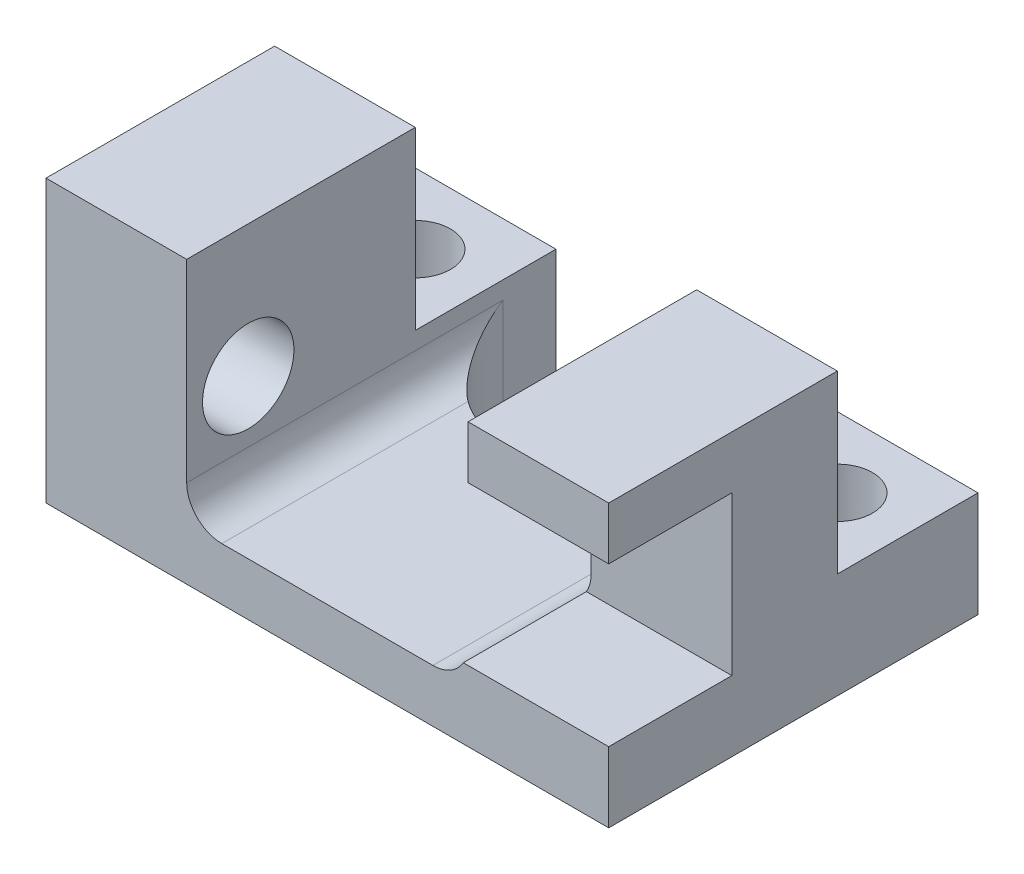
ISO-10303-21;
HEADER;
FILE_DESCRIPTION(('STEP AP214'),'2;1');
FILE_NAME('part.step','',(''),(''),'','','');
FILE_SCHEMA(('AUTOMOTIVE_DESIGN { 1 0 10303 214 1 1 1 1 }'));
ENDSEC;
DATA;
#1=APPLICATION_CONTEXT('core data for automotive mechanical design processes');
#2=APPLICATION_PROTOCOL_DEFINITION('international standard','automotive_design',2000,#1);
#3=PRODUCT_CONTEXT('',#1,'mechanical');
#4=PRODUCT('Part','Part','',(#3));
#5=PRODUCT_RELATED_PRODUCT_CATEGORY('part','',(#4));
#6=PRODUCT_DEFINITION_FORMATION('','',#4);
#7=PRODUCT_DEFINITION_CONTEXT('part definition',#1,'design');
#8=PRODUCT_DEFINITION('design','',#6,#7);
#9=PRODUCT_DEFINITION_SHAPE('','',#8);
#10=(LENGTH_UNIT() NAMED_UNIT(*) SI_UNIT(.MILLI.,.METRE.));
#11=(NAMED_UNIT(*) PLANE_ANGLE_UNIT() SI_UNIT($,.RADIAN.));
#12=(NAMED_UNIT(*) SI_UNIT($,.STERADIAN.) SOLID_ANGLE_UNIT());
#13=UNCERTAINTY_MEASURE_WITH_UNIT(LENGTH_MEASURE(1.E-05),#10,'distance_accuracy_value','');
#14=(GEOMETRIC_REPRESENTATION_CONTEXT(3) GLOBAL_UNCERTAINTY_ASSIGNED_CONTEXT((#13)) GLOBAL_UNIT_ASSIGNED_CONTEXT((#10,
#11,#12)) REPRESENTATION_CONTEXT('',''));
#15=CARTESIAN_POINT('',(0.,0.,0.));
#16=DIRECTION('',(0.,0.,1.));
#17=DIRECTION('',(1.,0.,0.));
#18=AXIS2_PLACEMENT_3D('',#15,#16,#17);
#19=CARTESIAN_POINT('',(-8.,4.,3.25));
#20=DIRECTION('',(0.,0.,-1.));
#21=DIRECTION('',(-1.,0.,0.));
#22=AXIS2_PLACEMENT_3D('',#19,#20,#21);
#23=PLANE('',#22);
#24=DIRECTION('',(0.,-1.,0.));
#25=VECTOR('',#24,1.);
#26=CARTESIAN_POINT('',(8.,4.,3.25));
#27=LINE('',#26,#25);
#28=CARTESIAN_POINT('',(8.,-2.,3.25));
#29=VERTEX_POINT('',#28);
#30=CARTESIAN_POINT('',(8.,-4.,3.25));
#31=VERTEX_POINT('',#30);
#32=EDGE_CURVE('E304',#29,#31,#27,.T.);
#33=ORIENTED_EDGE('',*,*,#32,.F.);
#34=DIRECTION('',(1.,0.,0.));
#35=VECTOR('',#34,1.);
#36=CARTESIAN_POINT('',(3.,-2.,3.25));
#37=LINE('',#36,#35);
#38=CARTESIAN_POINT('',(3.86602540378444,-2.,3.25));
#39=VERTEX_POINT('',#38);
#40=EDGE_CURVE('E211',#39,#29,#37,.T.);
#41=ORIENTED_EDGE('',*,*,#40,.F.);
#42=CARTESIAN_POINT('',(3.,-1.5,3.25));
#43=DIRECTION('',(0.,0.,-1.));
#44=DIRECTION('',(-1.,0.,0.));
#45=AXIS2_PLACEMENT_3D('',#42,#43,#44);
#46=CIRCLE('',#45,1.);
#47=CARTESIAN_POINT('',(3.,-2.5,3.25));
#48=VERTEX_POINT('',#47);
#49=EDGE_CURVE('E337',#39,#48,#46,.T.);
#50=ORIENTED_EDGE('',*,*,#49,.T.);
#51=DIRECTION('',(-1.,0.,0.));
#52=VECTOR('',#51,1.);
#53=CARTESIAN_POINT('',(-4.,-2.5,3.25));
#54=LINE('',#53,#52);
#55=CARTESIAN_POINT('',(-3.,-2.5,3.25));
#56=VERTEX_POINT('',#55);
#57=EDGE_CURVE('E270',#48,#56,#54,.T.);
#58=ORIENTED_EDGE('',*,*,#57,.T.);
#59=CARTESIAN_POINT('',(-3.,-1.5,3.25));
#60=DIRECTION('',(0.,0.,-1.));
#61=DIRECTION('',(-1.,0.,0.));
#62=AXIS2_PLACEMENT_3D('',#59,#60,#61);
#63=CIRCLE('',#62,1.);
#64=CARTESIAN_POINT('',(-4.,-1.5,3.25));
#65=VERTEX_POINT('',#64);
#66=EDGE_CURVE('E335',#56,#65,#63,.T.);
#67=ORIENTED_EDGE('',*,*,#66,.T.);
#68=DIRECTION('',(0.,1.,0.));
#69=VECTOR('',#68,1.);
#70=CARTESIAN_POINT('',(-4.,-2.5,3.25));
#71=LINE('',#70,#69);
#72=CARTESIAN_POINT('',(-4.,4.,3.25));
#73=VERTEX_POINT('',#72);
#74=EDGE_CURVE('E285',#65,#73,#71,.T.);
#75=ORIENTED_EDGE('',*,*,#74,.T.);
#76=DIRECTION('',(1.,0.,0.));
#77=VECTOR('',#76,1.);
#78=CARTESIAN_POINT('',(-8.,4.,3.25));
#79=LINE('',#78,#77);
#80=CARTESIAN_POINT('',(-8.,4.,3.25));
#81=VERTEX_POINT('',#80);
#82=EDGE_CURVE('E301',#81,#73,#79,.T.);
#83=ORIENTED_EDGE('',*,*,#82,.F.);
#84=DIRECTION('',(0.,-1.,0.));
#85=VECTOR('',#84,1.);
#86=CARTESIAN_POINT('',(-8.,4.,3.25));
#87=LINE('',#86,#85);
#88=CARTESIAN_POINT('',(-8.,-4.,3.25));
#89=VERTEX_POINT('',#88);
#90=EDGE_CURVE('E314',#81,#89,#87,.T.);
#91=ORIENTED_EDGE('',*,*,#90,.T.);
#92=DIRECTION('',(1.,0.,0.));
#93=VECTOR('',#92,1.);
#94=CARTESIAN_POINT('',(-8.,-4.,3.25));
#95=LINE('',#94,#93);
#96=EDGE_CURVE('E294',#89,#31,#95,.T.);
#97=ORIENTED_EDGE('',*,*,#96,.T.);
#98=EDGE_LOOP('',(#33,#41,#50,#58,#67,#75,#83,#91,#97));
#99=FACE_BOUND('',#98,.T.);
#100=ADVANCED_FACE('F32',(#99),#23,.F.);
#101=CARTESIAN_POINT('',(-8.,4.,-3.25));
#102=DIRECTION('',(0.,0.,1.));
#103=DIRECTION('',(1.,0.,0.));
#104=AXIS2_PLACEMENT_3D('',#101,#102,#103);
#105=PLANE('',#104);
#106=DIRECTION('',(-1.,0.,0.));
#107=VECTOR('',#106,1.);
#108=CARTESIAN_POINT('',(-8.,-1.,-3.25));
#109=LINE('',#108,#107);
#110=CARTESIAN_POINT('',(-4.,-1.,-3.25));
#111=VERTEX_POINT('',#110);
#112=CARTESIAN_POINT('',(-8.,-1.,-3.25));
#113=VERTEX_POINT('',#112);
#114=EDGE_CURVE('E233',#111,#113,#109,.T.);
#115=ORIENTED_EDGE('',*,*,#114,.T.);
#116=DIRECTION('',(0.,-1.,0.));
#117=VECTOR('',#116,1.);
#118=CARTESIAN_POINT('',(-8.,4.,-3.25));
#119=LINE('',#118,#117);
#120=CARTESIAN_POINT('',(-8.,4.,-3.25));
#121=VERTEX_POINT('',#120);
#122=EDGE_CURVE('E317',#121,#113,#119,.T.);
#123=ORIENTED_EDGE('',*,*,#122,.F.);
#124=DIRECTION('',(-1.,0.,0.));
#125=VECTOR('',#124,1.);
#126=CARTESIAN_POINT('',(-8.,4.,-3.25));
#127=LINE('',#126,#125);
#128=CARTESIAN_POINT('',(-4.,4.,-3.25));
#129=VERTEX_POINT('',#128);
#130=EDGE_CURVE('E293',#129,#121,#127,.T.);
#131=ORIENTED_EDGE('',*,*,#130,.F.);
#132=DIRECTION('',(0.,1.,0.));
#133=VECTOR('',#132,1.);
#134=CARTESIAN_POINT('',(-4.,-2.5,-3.25));
#135=LINE('',#134,#133);
#136=EDGE_CURVE('E283',#111,#129,#135,.T.);
#137=ORIENTED_EDGE('',*,*,#136,.F.);
#138=EDGE_LOOP('',(#115,#123,#131,#137));
#139=FACE_BOUND('',#138,.T.);
#140=ADVANCED_FACE('F452',(#139),#105,.F.);
#141=DIRECTION('',(0.,-1.,0.));
#142=VECTOR('',#141,1.);
#143=CARTESIAN_POINT('',(8.,4.,-3.25));
#144=LINE('',#143,#142);
#145=CARTESIAN_POINT('',(8.,4.,-3.25));
#146=VERTEX_POINT('',#145);
#147=CARTESIAN_POINT('',(8.,-1.,-3.25));
#148=VERTEX_POINT('',#147);
#149=EDGE_CURVE('E320',#146,#148,#144,.T.);
#150=ORIENTED_EDGE('',*,*,#149,.T.);
#151=DIRECTION('',(-1.,0.,0.));
#152=VECTOR('',#151,1.);
#153=CARTESIAN_POINT('',(8.,-1.,-3.25));
#154=LINE('',#153,#152);
#155=CARTESIAN_POINT('',(4.,-1.,-3.25));
#156=VERTEX_POINT('',#155);
#157=EDGE_CURVE('E250',#148,#156,#154,.T.);
#158=ORIENTED_EDGE('',*,*,#157,.T.);
#159=DIRECTION('',(0.,1.,0.));
#160=VECTOR('',#159,1.);
#161=CARTESIAN_POINT('',(4.,-2.5,-3.25));
#162=LINE('',#161,#160);
#163=CARTESIAN_POINT('',(4.,4.,-3.25));
#164=VERTEX_POINT('',#163);
#165=EDGE_CURVE('E277',#156,#164,#162,.T.);
#166=ORIENTED_EDGE('',*,*,#165,.T.);
#167=EDGE_CURVE('E295',#146,#164,#127,.T.);
#168=ORIENTED_EDGE('',*,*,#167,.F.);
#169=EDGE_LOOP('',(#150,#158,#166,#168));
#170=FACE_BOUND('',#169,.T.);
#171=ADVANCED_FACE('F433',(#170),#105,.F.);
#172=DIRECTION('',(-1.,0.,0.));
#173=VECTOR('',#172,1.);
#174=CARTESIAN_POINT('',(-8.,-4.,-3.25));
#175=LINE('',#174,#173);
#176=CARTESIAN_POINT('',(1.5,-4.,-3.25));
#177=VERTEX_POINT('',#176);
#178=CARTESIAN_POINT('',(-1.5,-4.,-3.25));
#179=VERTEX_POINT('',#178);
#180=EDGE_CURVE('E306',#177,#179,#175,.T.);
#181=ORIENTED_EDGE('',*,*,#180,.T.);
#182=DIRECTION('',(0.,-1.,0.));
#183=VECTOR('',#182,1.);
#184=CARTESIAN_POINT('',(-1.5,4.,-3.25));
#185=LINE('',#184,#183);
#186=CARTESIAN_POINT('',(-1.5,-2.5,-3.25));
#187=VERTEX_POINT('',#186);
#188=EDGE_CURVE('E345',#179,#187,#185,.F.);
#189=ORIENTED_EDGE('',*,*,#188,.T.);
#190=DIRECTION('',(1.,0.,0.));
#191=VECTOR('',#190,1.);
#192=CARTESIAN_POINT('',(-4.,-2.5,-3.25));
#193=LINE('',#192,#191);
#194=CARTESIAN_POINT('',(1.5,-2.5,-3.25));
#195=VERTEX_POINT('',#194);
#196=EDGE_CURVE('E273',#187,#195,#193,.T.);
#197=ORIENTED_EDGE('',*,*,#196,.T.);
#198=DIRECTION('',(0.,-1.,0.));
#199=VECTOR('',#198,1.);
#200=CARTESIAN_POINT('',(1.5,4.,-3.25));
#201=LINE('',#200,#199);
#202=EDGE_CURVE('E342',#195,#177,#201,.T.);
#203=ORIENTED_EDGE('',*,*,#202,.T.);
#204=EDGE_LOOP('',(#181,#189,#197,#203));
#205=FACE_BOUND('',#204,.T.);
#206=ADVANCED_FACE('F443',(#205),#105,.F.);
#207=DIRECTION('',(0.,1.,0.));
#208=VECTOR('',#207,1.);
#209=CARTESIAN_POINT('',(4.,-2.5,3.25));
#210=LINE('',#209,#208);
#211=CARTESIAN_POINT('',(4.,2.5,3.25));
#212=VERTEX_POINT('',#211);
#213=CARTESIAN_POINT('',(4.,4.,3.25));
#214=VERTEX_POINT('',#213);
#215=EDGE_CURVE('E287',#212,#214,#210,.T.);
#216=ORIENTED_EDGE('',*,*,#215,.F.);
#217=DIRECTION('',(1.,0.,0.));
#218=VECTOR('',#217,1.);
#219=CARTESIAN_POINT('',(3.,2.5,3.25));
#220=LINE('',#219,#218);
#221=CARTESIAN_POINT('',(8.,2.5,3.25));
#222=VERTEX_POINT('',#221);
#223=EDGE_CURVE('E190',#212,#222,#220,.T.);
#224=ORIENTED_EDGE('',*,*,#223,.T.);
#225=CARTESIAN_POINT('',(8.,4.,3.25));
#226=VERTEX_POINT('',#225);
#227=EDGE_CURVE('E204',#226,#222,#27,.T.);
#228=ORIENTED_EDGE('',*,*,#227,.F.);
#229=EDGE_CURVE('E300',#214,#226,#79,.T.);
#230=ORIENTED_EDGE('',*,*,#229,.F.);
#231=EDGE_LOOP('',(#216,#224,#228,#230));
#232=FACE_BOUND('',#231,.T.);
#233=ADVANCED_FACE('F441',(#232),#23,.F.);
#234=CARTESIAN_POINT('',(0.,4.,0.));
#235=DIRECTION('',(0.,-1.,0.));
#236=DIRECTION('',(0.,0.,-1.));
#237=AXIS2_PLACEMENT_3D('',#234,#235,#236);
#238=PLANE('',#237);
#239=DIRECTION('',(0.,0.,1.));
#240=VECTOR('',#239,1.);
#241=CARTESIAN_POINT('',(4.,4.,3.25));
#242=LINE('',#241,#240);
#243=EDGE_CURVE('E267',#164,#214,#242,.T.);
#244=ORIENTED_EDGE('',*,*,#243,.T.);
#245=ORIENTED_EDGE('',*,*,#229,.T.);
#246=DIRECTION('',(0.,0.,-1.));
#247=VECTOR('',#246,1.);
#248=CARTESIAN_POINT('',(8.,4.,3.25));
#249=LINE('',#248,#247);
#250=EDGE_CURVE('E290',#226,#146,#249,.T.);
#251=ORIENTED_EDGE('',*,*,#250,.T.);
#252=ORIENTED_EDGE('',*,*,#167,.T.);
#253=EDGE_LOOP('',(#244,#245,#251,#252));
#254=FACE_BOUND('',#253,.T.);
#255=ADVANCED_FACE('F437',(#254),#238,.F.);
#256=DIRECTION('',(0.,0.,-1.));
#257=VECTOR('',#256,1.);
#258=CARTESIAN_POINT('',(-4.,4.,3.25));
#259=LINE('',#258,#257);
#260=EDGE_CURVE('E274',#73,#129,#259,.T.);
#261=ORIENTED_EDGE('',*,*,#260,.T.);
#262=ORIENTED_EDGE('',*,*,#130,.T.);
#263=DIRECTION('',(0.,0.,1.));
#264=VECTOR('',#263,1.);
#265=CARTESIAN_POINT('',(-8.,4.,3.25));
#266=LINE('',#265,#264);
#267=EDGE_CURVE('E298',#121,#81,#266,.T.);
#268=ORIENTED_EDGE('',*,*,#267,.T.);
#269=ORIENTED_EDGE('',*,*,#82,.T.);
#270=EDGE_LOOP('',(#261,#262,#268,#269));
#271=FACE_BOUND('',#270,.T.);
#272=ADVANCED_FACE('F416',(#271),#238,.F.);
#273=CARTESIAN_POINT('',(8.,4.,3.25));
#274=DIRECTION('',(-1.,0.,0.));
#275=DIRECTION('',(0.,0.,1.));
#276=AXIS2_PLACEMENT_3D('',#273,#274,#275);
#277=PLANE('',#276);
#278=DIRECTION('',(0.,1.,0.));
#279=VECTOR('',#278,1.);
#280=CARTESIAN_POINT('',(8.,2.5,-0.25));
#281=LINE('',#280,#279);
#282=CARTESIAN_POINT('',(8.,-2.,-0.25));
#283=VERTEX_POINT('',#282);
#284=CARTESIAN_POINT('',(8.,2.5,-0.25));
#285=VERTEX_POINT('',#284);
#286=EDGE_CURVE('E194',#283,#285,#281,.T.);
#287=ORIENTED_EDGE('',*,*,#286,.F.);
#288=DIRECTION('',(0.,0.,-1.));
#289=VECTOR('',#288,1.);
#290=CARTESIAN_POINT('',(8.,-2.,-0.25));
#291=LINE('',#290,#289);
#292=EDGE_CURVE('E191',#29,#283,#291,.T.);
#293=ORIENTED_EDGE('',*,*,#292,.F.);
#294=ORIENTED_EDGE('',*,*,#32,.T.);
#295=DIRECTION('',(0.,0.,-1.));
#296=VECTOR('',#295,1.);
#297=CARTESIAN_POINT('',(8.,-4.,3.25));
#298=LINE('',#297,#296);
#299=CARTESIAN_POINT('',(8.,-4.,-7.25));
#300=VERTEX_POINT('',#299);
#301=EDGE_CURVE('E289',#31,#300,#298,.T.);
#302=ORIENTED_EDGE('',*,*,#301,.T.);
#303=DIRECTION('',(0.,-1.,0.));
#304=VECTOR('',#303,1.);
#305=CARTESIAN_POINT('',(8.,-1.,-7.25));
#306=LINE('',#305,#304);
#307=CARTESIAN_POINT('',(8.,-1.,-7.25));
#308=VERTEX_POINT('',#307);
#309=EDGE_CURVE('E264',#308,#300,#306,.T.);
#310=ORIENTED_EDGE('',*,*,#309,.F.);
#311=DIRECTION('',(0.,0.,1.));
#312=VECTOR('',#311,1.);
#313=CARTESIAN_POINT('',(8.,-1.,-3.25));
#314=LINE('',#313,#312);
#315=EDGE_CURVE('E247',#308,#148,#314,.T.);
#316=ORIENTED_EDGE('',*,*,#315,.T.);
#317=ORIENTED_EDGE('',*,*,#149,.F.);
#318=ORIENTED_EDGE('',*,*,#250,.F.);
#319=ORIENTED_EDGE('',*,*,#227,.T.);
#320=DIRECTION('',(0.,0.,1.));
#321=VECTOR('',#320,1.);
#322=CARTESIAN_POINT('',(8.,2.5,-0.25));
#323=LINE('',#322,#321);
#324=EDGE_CURVE('E185',#285,#222,#323,.T.);
#325=ORIENTED_EDGE('',*,*,#324,.F.);
#326=EDGE_LOOP('',(#287,#293,#294,#302,#310,#316,#317,#318,#319,#325));
#327=FACE_BOUND('',#326,.T.);
#328=ADVANCED_FACE('F201',(#327),#277,.F.);
#329=CARTESIAN_POINT('',(-8.,4.,3.25));
#330=DIRECTION('',(1.,0.,0.));
#331=DIRECTION('',(0.,0.,-1.));
#332=AXIS2_PLACEMENT_3D('',#329,#330,#331);
#333=PLANE('',#332);
#334=CARTESIAN_POINT('',(-8.,0.250000000000001,1.5));
#335=DIRECTION('',(-1.,0.,0.));
#336=DIRECTION('',(0.,0.,1.));
#337=AXIS2_PLACEMENT_3D('',#334,#335,#336);
#338=CIRCLE('',#337,1.3);
#339=CARTESIAN_POINT('',(-8.,0.250000000000001,2.8));
#340=VERTEX_POINT('',#339);
#341=EDGE_CURVE('E521',#340,#340,#338,.T.);
#342=ORIENTED_EDGE('',*,*,#341,.F.);
#343=EDGE_LOOP('',(#342));
#344=FACE_BOUND('',#343,.T.);
#345=DIRECTION('',(0.,0.,1.));
#346=VECTOR('',#345,1.);
#347=CARTESIAN_POINT('',(-8.,-4.,3.25));
#348=LINE('',#347,#346);
#349=CARTESIAN_POINT('',(-8.,-4.,-7.25));
#350=VERTEX_POINT('',#349);
#351=EDGE_CURVE('E309',#350,#89,#348,.T.);
#352=ORIENTED_EDGE('',*,*,#351,.T.);
#353=ORIENTED_EDGE('',*,*,#90,.F.);
#354=ORIENTED_EDGE('',*,*,#267,.F.);
#355=ORIENTED_EDGE('',*,*,#122,.T.);
#356=DIRECTION('',(0.,0.,-1.));
#357=VECTOR('',#356,1.);
#358=CARTESIAN_POINT('',(-8.,-1.,-3.25));
#359=LINE('',#358,#357);
#360=CARTESIAN_POINT('',(-8.,-1.,-7.25));
#361=VERTEX_POINT('',#360);
#362=EDGE_CURVE('E223',#113,#361,#359,.T.);
#363=ORIENTED_EDGE('',*,*,#362,.T.);
#364=DIRECTION('',(0.,-1.,0.));
#365=VECTOR('',#364,1.);
#366=CARTESIAN_POINT('',(-8.,-1.,-7.25));
#367=LINE('',#366,#365);
#368=EDGE_CURVE('E236',#361,#350,#367,.T.);
#369=ORIENTED_EDGE('',*,*,#368,.T.);
#370=EDGE_LOOP('',(#352,#353,#354,#355,#363,#369));
#371=FACE_BOUND('',#370,.T.);
#372=ADVANCED_FACE('F463',(#344,#371),#333,.F.);
#373=CARTESIAN_POINT('',(0.,-4.,0.));
#374=DIRECTION('',(0.,-1.,0.));
#375=DIRECTION('',(0.,0.,-1.));
#376=AXIS2_PLACEMENT_3D('',#373,#374,#375);
#377=PLANE('',#376);
#378=CARTESIAN_POINT('',(6.,-4.,-5.25));
#379=DIRECTION('',(0.,-1.,0.));
#380=DIRECTION('',(0.,0.,-1.));
#381=AXIS2_PLACEMENT_3D('',#378,#379,#380);
#382=CIRCLE('',#381,0.999999999999999);
#383=CARTESIAN_POINT('',(6.,-4.,-6.25));
#384=VERTEX_POINT('',#383);
#385=EDGE_CURVE('E218',#384,#384,#382,.T.);
#386=ORIENTED_EDGE('',*,*,#385,.F.);
#387=EDGE_LOOP('',(#386));
#388=FACE_BOUND('',#387,.T.);
#389=CARTESIAN_POINT('',(-6.,-4.,-5.25));
#390=DIRECTION('',(0.,-1.,0.));
#391=DIRECTION('',(0.,0.,-1.));
#392=AXIS2_PLACEMENT_3D('',#389,#390,#391);
#393=CIRCLE('',#392,0.999999999999999);
#394=CARTESIAN_POINT('',(-6.,-4.,-6.25));
#395=VERTEX_POINT('',#394);
#396=EDGE_CURVE('E222',#395,#395,#393,.T.);
#397=ORIENTED_EDGE('',*,*,#396,.F.);
#398=EDGE_LOOP('',(#397));
#399=FACE_BOUND('',#398,.T.);
#400=ORIENTED_EDGE('',*,*,#301,.F.);
#401=ORIENTED_EDGE('',*,*,#96,.F.);
#402=ORIENTED_EDGE('',*,*,#351,.F.);
#403=DIRECTION('',(1.,0.,0.));
#404=VECTOR('',#403,1.);
#405=CARTESIAN_POINT('',(-8.,-4.,-7.25));
#406=LINE('',#405,#404);
#407=CARTESIAN_POINT('',(-4.,-4.,-7.25));
#408=VERTEX_POINT('',#407);
#409=EDGE_CURVE('E237',#350,#408,#406,.T.);
#410=ORIENTED_EDGE('',*,*,#409,.T.);
#411=DIRECTION('',(0.,0.,1.));
#412=VECTOR('',#411,1.);
#413=CARTESIAN_POINT('',(-4.,-4.,-3.25));
#414=LINE('',#413,#412);
#415=CARTESIAN_POINT('',(-4.,-4.,-5.75));
#416=VERTEX_POINT('',#415);
#417=EDGE_CURVE('E227',#408,#416,#414,.T.);
#418=ORIENTED_EDGE('',*,*,#417,.T.);
#419=CARTESIAN_POINT('',(-1.5,-4.,-5.75));
#420=DIRECTION('',(0.,-1.,0.));
#421=DIRECTION('',(0.,0.,-1.));
#422=AXIS2_PLACEMENT_3D('',#419,#420,#421);
#423=CIRCLE('',#422,2.5);
#424=EDGE_CURVE('E350',#416,#179,#423,.F.);
#425=ORIENTED_EDGE('',*,*,#424,.T.);
#426=ORIENTED_EDGE('',*,*,#180,.F.);
#427=CARTESIAN_POINT('',(1.5,-4.,-5.75));
#428=DIRECTION('',(0.,-1.,0.));
#429=DIRECTION('',(0.,0.,-1.));
#430=AXIS2_PLACEMENT_3D('',#427,#428,#429);
#431=CIRCLE('',#430,2.5);
#432=CARTESIAN_POINT('',(4.,-4.,-5.75));
#433=VERTEX_POINT('',#432);
#434=EDGE_CURVE('E363',#177,#433,#431,.F.);
#435=ORIENTED_EDGE('',*,*,#434,.T.);
#436=DIRECTION('',(0.,0.,-1.));
#437=VECTOR('',#436,1.);
#438=CARTESIAN_POINT('',(4.,-4.,-3.25));
#439=LINE('',#438,#437);
#440=CARTESIAN_POINT('',(4.,-4.,-7.25));
#441=VERTEX_POINT('',#440);
#442=EDGE_CURVE('E244',#433,#441,#439,.T.);
#443=ORIENTED_EDGE('',*,*,#442,.T.);
#444=DIRECTION('',(1.,0.,0.));
#445=VECTOR('',#444,1.);
#446=CARTESIAN_POINT('',(8.,-4.,-7.25));
#447=LINE('',#446,#445);
#448=EDGE_CURVE('E251',#441,#300,#447,.T.);
#449=ORIENTED_EDGE('',*,*,#448,.T.);
#450=EDGE_LOOP('',(#400,#401,#402,#410,#418,#425,#426,#435,#443,#449));
#451=FACE_BOUND('',#450,.T.);
#452=ADVANCED_FACE('F423',(#388,#399,#451),#377,.T.);
#453=CARTESIAN_POINT('',(4.,-2.5,3.25));
#454=DIRECTION('',(-1.,0.,0.));
#455=DIRECTION('',(0.,0.,1.));
#456=AXIS2_PLACEMENT_3D('',#453,#454,#455);
#457=PLANE('',#456);
#458=DIRECTION('',(0.,-1.,0.));
#459=VECTOR('',#458,1.);
#460=CARTESIAN_POINT('',(4.,-2.5,-0.25));
#461=LINE('',#460,#459);
#462=CARTESIAN_POINT('',(4.,2.5,-0.25));
#463=VERTEX_POINT('',#462);
#464=CARTESIAN_POINT('',(4.,-1.5,-0.25));
#465=VERTEX_POINT('',#464);
#466=EDGE_CURVE('E210',#463,#465,#461,.T.);
#467=ORIENTED_EDGE('',*,*,#466,.F.);
#468=DIRECTION('',(0.,0.,-1.));
#469=VECTOR('',#468,1.);
#470=CARTESIAN_POINT('',(4.,2.5,3.25));
#471=LINE('',#470,#469);
#472=EDGE_CURVE('E11',#212,#463,#471,.T.);
#473=ORIENTED_EDGE('',*,*,#472,.F.);
#474=ORIENTED_EDGE('',*,*,#215,.T.);
#475=ORIENTED_EDGE('',*,*,#243,.F.);
#476=ORIENTED_EDGE('',*,*,#165,.F.);
#477=DIRECTION('',(0.,0.,-1.));
#478=VECTOR('',#477,1.);
#479=CARTESIAN_POINT('',(4.,-1.,-3.25));
#480=LINE('',#479,#478);
#481=CARTESIAN_POINT('',(4.,-1.,-7.25));
#482=VERTEX_POINT('',#481);
#483=EDGE_CURVE('E254',#156,#482,#480,.T.);
#484=ORIENTED_EDGE('',*,*,#483,.T.);
#485=DIRECTION('',(0.,-1.,0.));
#486=VECTOR('',#485,1.);
#487=CARTESIAN_POINT('',(4.,-1.,-7.25));
#488=LINE('',#487,#486);
#489=EDGE_CURVE('E260',#482,#441,#488,.T.);
#490=ORIENTED_EDGE('',*,*,#489,.T.);
#491=ORIENTED_EDGE('',*,*,#442,.F.);
#492=DIRECTION('',(0.,-1.,0.));
#493=VECTOR('',#492,1.);
#494=CARTESIAN_POINT('',(4.,-2.5,-5.75));
#495=LINE('',#494,#493);
#496=CARTESIAN_POINT('',(4.,-1.5,-5.75));
#497=VERTEX_POINT('',#496);
#498=EDGE_CURVE('E347',#433,#497,#495,.F.);
#499=ORIENTED_EDGE('',*,*,#498,.T.);
#500=DIRECTION('',(0.,0.,1.));
#501=VECTOR('',#500,1.);
#502=CARTESIAN_POINT('',(4.,-1.5,3.25));
#503=LINE('',#502,#501);
#504=EDGE_CURVE('E332',#497,#465,#503,.T.);
#505=ORIENTED_EDGE('',*,*,#504,.T.);
#506=EDGE_LOOP('',(#467,#473,#474,#475,#476,#484,#490,#491,#499,#505));
#507=FACE_BOUND('',#506,.T.);
#508=ADVANCED_FACE('F390',(#507),#457,.T.);
#509=CARTESIAN_POINT('',(-4.,-2.5,3.25));
#510=DIRECTION('',(1.,0.,0.));
#511=DIRECTION('',(0.,0.,-1.));
#512=AXIS2_PLACEMENT_3D('',#509,#510,#511);
#513=PLANE('',#512);
#514=CARTESIAN_POINT('',(-4.,0.250000000000001,1.5));
#515=DIRECTION('',(-1.,0.,0.));
#516=DIRECTION('',(0.,0.,1.));
#517=AXIS2_PLACEMENT_3D('',#514,#515,#516);
#518=CIRCLE('',#517,1.3);
#519=CARTESIAN_POINT('',(-4.,0.250000000000001,2.8));
#520=VERTEX_POINT('',#519);
#521=EDGE_CURVE('E198',#520,#520,#518,.T.);
#522=ORIENTED_EDGE('',*,*,#521,.T.);
#523=EDGE_LOOP('',(#522));
#524=FACE_BOUND('',#523,.T.);
#525=DIRECTION('',(0.,0.,-1.));
#526=VECTOR('',#525,1.);
#527=CARTESIAN_POINT('',(-4.,-1.5,3.25));
#528=LINE('',#527,#526);
#529=CARTESIAN_POINT('',(-4.,-1.5,-5.75));
#530=VERTEX_POINT('',#529);
#531=EDGE_CURVE('E323',#65,#530,#528,.T.);
#532=ORIENTED_EDGE('',*,*,#531,.T.);
#533=DIRECTION('',(0.,-1.,0.));
#534=VECTOR('',#533,1.);
#535=CARTESIAN_POINT('',(-4.,-2.5,-5.75));
#536=LINE('',#535,#534);
#537=EDGE_CURVE('E339',#530,#416,#536,.T.);
#538=ORIENTED_EDGE('',*,*,#537,.T.);
#539=ORIENTED_EDGE('',*,*,#417,.F.);
#540=DIRECTION('',(0.,-1.,0.));
#541=VECTOR('',#540,1.);
#542=CARTESIAN_POINT('',(-4.,-1.,-7.25));
#543=LINE('',#542,#541);
#544=CARTESIAN_POINT('',(-4.,-1.,-7.25));
#545=VERTEX_POINT('',#544);
#546=EDGE_CURVE('E242',#545,#408,#543,.T.);
#547=ORIENTED_EDGE('',*,*,#546,.F.);
#548=DIRECTION('',(0.,0.,1.));
#549=VECTOR('',#548,1.);
#550=CARTESIAN_POINT('',(-4.,-1.,-3.25));
#551=LINE('',#550,#549);
#552=EDGE_CURVE('E230',#545,#111,#551,.T.);
#553=ORIENTED_EDGE('',*,*,#552,.T.);
#554=ORIENTED_EDGE('',*,*,#136,.T.);
#555=ORIENTED_EDGE('',*,*,#260,.F.);
#556=ORIENTED_EDGE('',*,*,#74,.F.);
#557=EDGE_LOOP('',(#532,#538,#539,#547,#553,#554,#555,#556));
#558=FACE_BOUND('',#557,.T.);
#559=ADVANCED_FACE('F412',(#524,#558),#513,.T.);
#560=CARTESIAN_POINT('',(0.,-2.5,0.));
#561=DIRECTION('',(0.,-1.,0.));
#562=DIRECTION('',(0.,0.,-1.));
#563=AXIS2_PLACEMENT_3D('',#560,#561,#562);
#564=PLANE('',#563);
#565=ORIENTED_EDGE('',*,*,#196,.F.);
#566=CARTESIAN_POINT('',(-1.5,-2.5,-5.75));
#567=DIRECTION('',(0.,-1.,0.));
#568=DIRECTION('',(0.,0.,-1.));
#569=AXIS2_PLACEMENT_3D('',#566,#567,#568);
#570=CIRCLE('',#569,2.5);
#571=CARTESIAN_POINT('',(-3.,-2.5,-3.74999999999967));
#572=VERTEX_POINT('',#571);
#573=EDGE_CURVE('E352',#187,#572,#570,.T.);
#574=ORIENTED_EDGE('',*,*,#573,.T.);
#575=DIRECTION('',(0.,0.,-1.));
#576=VECTOR('',#575,1.);
#577=CARTESIAN_POINT('',(-3.,-2.5,0.));
#578=LINE('',#577,#576);
#579=EDGE_CURVE('E330',#572,#56,#578,.F.);
#580=ORIENTED_EDGE('',*,*,#579,.T.);
#581=ORIENTED_EDGE('',*,*,#57,.F.);
#582=DIRECTION('',(0.,0.,1.));
#583=VECTOR('',#582,1.);
#584=CARTESIAN_POINT('',(3.,-2.5,0.));
#585=LINE('',#584,#583);
#586=CARTESIAN_POINT('',(3.,-2.5,-3.74999999999967));
#587=VERTEX_POINT('',#586);
#588=EDGE_CURVE('E56',#48,#587,#585,.F.);
#589=ORIENTED_EDGE('',*,*,#588,.T.);
#590=CARTESIAN_POINT('',(1.5,-2.5,-5.75));
#591=DIRECTION('',(0.,-1.,0.));
#592=DIRECTION('',(0.,0.,-1.));
#593=AXIS2_PLACEMENT_3D('',#590,#591,#592);
#594=CIRCLE('',#593,2.5);
#595=EDGE_CURVE('E383',#587,#195,#594,.T.);
#596=ORIENTED_EDGE('',*,*,#595,.T.);
#597=EDGE_LOOP('',(#565,#574,#580,#581,#589,#596));
#598=FACE_BOUND('',#597,.T.);
#599=ADVANCED_FACE('F402',(#598),#564,.F.);
#600=CARTESIAN_POINT('',(8.,-1.,-7.25));
#601=DIRECTION('',(0.,0.,-1.));
#602=DIRECTION('',(-1.,0.,0.));
#603=AXIS2_PLACEMENT_3D('',#600,#601,#602);
#604=PLANE('',#603);
#605=ORIENTED_EDGE('',*,*,#448,.F.);
#606=ORIENTED_EDGE('',*,*,#489,.F.);
#607=DIRECTION('',(1.,0.,0.));
#608=VECTOR('',#607,1.);
#609=CARTESIAN_POINT('',(8.,-1.,-7.25));
#610=LINE('',#609,#608);
#611=EDGE_CURVE('E257',#482,#308,#610,.T.);
#612=ORIENTED_EDGE('',*,*,#611,.T.);
#613=ORIENTED_EDGE('',*,*,#309,.T.);
#614=EDGE_LOOP('',(#605,#606,#612,#613));
#615=FACE_BOUND('',#614,.T.);
#616=ADVANCED_FACE('F427',(#615),#604,.T.);
#617=CARTESIAN_POINT('',(0.,-1.,0.));
#618=DIRECTION('',(0.,1.,0.));
#619=DIRECTION('',(0.,0.,1.));
#620=AXIS2_PLACEMENT_3D('',#617,#618,#619);
#621=PLANE('',#620);
#622=CARTESIAN_POINT('',(6.,-1.,-5.25));
#623=DIRECTION('',(0.,1.,0.));
#624=DIRECTION('',(0.,0.,1.));
#625=AXIS2_PLACEMENT_3D('',#622,#623,#624);
#626=CIRCLE('',#625,0.999999999999999);
#627=CARTESIAN_POINT('',(6.,-1.,-4.25));
#628=VERTEX_POINT('',#627);
#629=EDGE_CURVE('E215',#628,#628,#626,.T.);
#630=ORIENTED_EDGE('',*,*,#629,.F.);
#631=EDGE_LOOP('',(#630));
#632=FACE_BOUND('',#631,.T.);
#633=ORIENTED_EDGE('',*,*,#315,.F.);
#634=ORIENTED_EDGE('',*,*,#611,.F.);
#635=ORIENTED_EDGE('',*,*,#483,.F.);
#636=ORIENTED_EDGE('',*,*,#157,.F.);
#637=EDGE_LOOP('',(#633,#634,#635,#636));
#638=FACE_BOUND('',#637,.T.);
#639=ADVANCED_FACE('F430',(#632,#638),#621,.T.);
#640=CARTESIAN_POINT('',(-8.,-1.,-7.25));
#641=DIRECTION('',(0.,0.,-1.));
#642=DIRECTION('',(-1.,0.,0.));
#643=AXIS2_PLACEMENT_3D('',#640,#641,#642);
#644=PLANE('',#643);
#645=ORIENTED_EDGE('',*,*,#409,.F.);
#646=ORIENTED_EDGE('',*,*,#368,.F.);
#647=DIRECTION('',(1.,0.,0.));
#648=VECTOR('',#647,1.);
#649=CARTESIAN_POINT('',(-8.,-1.,-7.25));
#650=LINE('',#649,#648);
#651=EDGE_CURVE('E226',#361,#545,#650,.T.);
#652=ORIENTED_EDGE('',*,*,#651,.T.);
#653=ORIENTED_EDGE('',*,*,#546,.T.);
#654=EDGE_LOOP('',(#645,#646,#652,#653));
#655=FACE_BOUND('',#654,.T.);
#656=ADVANCED_FACE('F493',(#655),#644,.T.);
#657=CARTESIAN_POINT('',(0.,-1.,0.));
#658=DIRECTION('',(0.,-1.,0.));
#659=DIRECTION('',(0.,0.,-1.));
#660=AXIS2_PLACEMENT_3D('',#657,#658,#659);
#661=PLANE('',#660);
#662=CARTESIAN_POINT('',(-6.,-1.,-5.25));
#663=DIRECTION('',(0.,1.,0.));
#664=DIRECTION('',(0.,0.,1.));
#665=AXIS2_PLACEMENT_3D('',#662,#663,#664);
#666=CIRCLE('',#665,0.999999999999999);
#667=CARTESIAN_POINT('',(-6.,-1.,-4.25));
#668=VERTEX_POINT('',#667);
#669=EDGE_CURVE('E219',#668,#668,#666,.T.);
#670=ORIENTED_EDGE('',*,*,#669,.F.);
#671=EDGE_LOOP('',(#670));
#672=FACE_BOUND('',#671,.T.);
#673=ORIENTED_EDGE('',*,*,#362,.F.);
#674=ORIENTED_EDGE('',*,*,#114,.F.);
#675=ORIENTED_EDGE('',*,*,#552,.F.);
#676=ORIENTED_EDGE('',*,*,#651,.F.);
#677=EDGE_LOOP('',(#673,#674,#675,#676));
#678=FACE_BOUND('',#677,.T.);
#679=ADVANCED_FACE('F487',(#672,#678),#661,.F.);
#680=CARTESIAN_POINT('',(-6.,-1.,-5.25));
#681=DIRECTION('',(0.,1.,0.));
#682=DIRECTION('',(0.,0.,1.));
#683=AXIS2_PLACEMENT_3D('',#680,#681,#682);
#684=CYLINDRICAL_SURFACE('',#683,0.999999999999999);
#685=ORIENTED_EDGE('',*,*,#396,.T.);
#686=EDGE_LOOP('',(#685));
#687=FACE_BOUND('',#686,.T.);
#688=ORIENTED_EDGE('',*,*,#669,.T.);
#689=EDGE_LOOP('',(#688));
#690=FACE_BOUND('',#689,.T.);
#691=ADVANCED_FACE('F483',(#687,#690),#684,.F.);
#692=CARTESIAN_POINT('',(6.,-1.,-5.25));
#693=DIRECTION('',(0.,1.,0.));
#694=DIRECTION('',(0.,0.,1.));
#695=AXIS2_PLACEMENT_3D('',#692,#693,#694);
#696=CYLINDRICAL_SURFACE('',#695,0.999999999999999);
#697=ORIENTED_EDGE('',*,*,#385,.T.);
#698=EDGE_LOOP('',(#697));
#699=FACE_BOUND('',#698,.T.);
#700=ORIENTED_EDGE('',*,*,#629,.T.);
#701=EDGE_LOOP('',(#700));
#702=FACE_BOUND('',#701,.T.);
#703=ADVANCED_FACE('F486',(#699,#702),#696,.F.);
#704=CARTESIAN_POINT('',(-3.,-1.5,3.25));
#705=DIRECTION('',(0.,0.,-1.));
#706=DIRECTION('',(-1.,0.,0.));
#707=AXIS2_PLACEMENT_3D('',#704,#705,#706);
#708=CYLINDRICAL_SURFACE('',#707,1.);
#709=ORIENTED_EDGE('',*,*,#66,.F.);
#710=ORIENTED_EDGE('',*,*,#579,.F.);
#711=CARTESIAN_POINT('',(-3.,-2.5,-3.74999999999967));
#712=CARTESIAN_POINT('',(-3.03421120874021,-2.49999597559318,-3.77565128338779));
#713=CARTESIAN_POINT('',(-3.06772297895691,-2.4982454623019,-3.80216376968815));
#714=CARTESIAN_POINT('',(-3.13311650247064,-2.49164486192553,-3.85666106606112));
#715=CARTESIAN_POINT('',(-3.16500097299606,-2.48680013741237,-3.88464325214709));
#716=CARTESIAN_POINT('',(-3.25742787498592,-2.46832538215328,-3.96999134375561));
#717=CARTESIAN_POINT('',(-3.3154263840069,-2.45073876930685,-4.02927402642896));
#718=CARTESIAN_POINT('',(-3.44699163439282,-2.39840805927538,-4.17748684800045));
#719=CARTESIAN_POINT('',(-3.51671959731349,-2.35954997704738,-4.26832194409374));
#720=CARTESIAN_POINT('',(-3.64156776486506,-2.27090106786571,-4.45523302617126));
#721=CARTESIAN_POINT('',(-3.69659547167422,-2.22104445881381,-4.5513378141029));
#722=CARTESIAN_POINT('',(-3.77834958479086,-2.12987419916042,-4.71799406828529));
#723=CARTESIAN_POINT('',(-3.80864712066633,-2.09032215504914,-4.78780513225424));
#724=CARTESIAN_POINT('',(-3.86238926030983,-2.00860341766354,-4.92854155787804));
#725=CARTESIAN_POINT('',(-3.88583083782694,-1.96643557969021,-4.99946739708819));
#726=CARTESIAN_POINT('',(-3.94613120115855,-1.83740514110442,-5.21305979399965));
#727=CARTESIAN_POINT('',(-3.97316437000286,-1.74778070302685,-5.35695683982884));
#728=CARTESIAN_POINT('',(-3.99559347075035,-1.60671816007266,-5.58124444434328));
#729=CARTESIAN_POINT('',(-3.99971490402869,-1.55603597222648,-5.66139869295911));
#730=CARTESIAN_POINT('',(-3.99999523295474,-1.50356348361028,-5.74436564198605));
#731=CARTESIAN_POINT('',(-3.99999999440166,-1.50178173997854,-5.74718282614736));
#732=CARTESIAN_POINT('',(-4.,-1.5,-5.75));
#733=B_SPLINE_CURVE_WITH_KNOTS('',3,(#711,#712,#713,#714,#715,#716,#717,#718,#719,#720,#721,
#722,#723,#724,#725,#726,#727,#728,#729,#730,#731,#732),.UNSPECIFIED.,.F.,.F.,(4,2,2,2,2,2,2,2,
2,2,4),(0.,0.128161856025585,0.256102195483279,0.509450072496358,0.870315129949138,
1.23340004003181,1.49037285629643,1.74745893091983,2.26009785643878,2.54460067457742,
2.55460068478159),.UNSPECIFIED.);
#734=EDGE_CURVE('E355',#572,#530,#733,.T.);
#735=ORIENTED_EDGE('',*,*,#734,.T.);
#736=ORIENTED_EDGE('',*,*,#531,.F.);
#737=EDGE_LOOP('',(#709,#710,#735,#736));
#738=FACE_BOUND('',#737,.T.);
#739=ADVANCED_FACE('F365',(#738),#708,.F.);
#740=CARTESIAN_POINT('',(3.,-1.5,3.25));
#741=DIRECTION('',(0.,0.,1.));
#742=DIRECTION('',(1.,0.,0.));
#743=AXIS2_PLACEMENT_3D('',#740,#741,#742);
#744=CYLINDRICAL_SURFACE('',#743,1.);
#745=DIRECTION('',(0.,0.,1.));
#746=VECTOR('',#745,1.);
#747=CARTESIAN_POINT('',(3.86602540378444,-2.,3.25));
#748=LINE('',#747,#746);
#749=CARTESIAN_POINT('',(3.86602540378444,-2.,-0.25));
#750=VERTEX_POINT('',#749);
#751=EDGE_CURVE('E385',#39,#750,#748,.F.);
#752=ORIENTED_EDGE('',*,*,#751,.T.);
#753=CARTESIAN_POINT('',(3.,-1.5,-0.25));
#754=DIRECTION('',(0.,0.,-1.));
#755=DIRECTION('',(-1.,0.,0.));
#756=AXIS2_PLACEMENT_3D('',#753,#754,#755);
#757=CIRCLE('',#756,1.);
#758=EDGE_CURVE('E41',#750,#465,#757,.F.);
#759=ORIENTED_EDGE('',*,*,#758,.T.);
#760=ORIENTED_EDGE('',*,*,#504,.F.);
#761=CARTESIAN_POINT('',(3.,-2.5,-3.74999999999967));
#762=CARTESIAN_POINT('',(3.03421120874021,-2.49999597559318,-3.77565128338779));
#763=CARTESIAN_POINT('',(3.06772297895692,-2.4982454623019,-3.80216376968815));
#764=CARTESIAN_POINT('',(3.13311650247065,-2.49164486192553,-3.85666106606113));
#765=CARTESIAN_POINT('',(3.16500097299607,-2.48680013741237,-3.8846432521471));
#766=CARTESIAN_POINT('',(3.25742787498593,-2.46832538215328,-3.96999134375562));
#767=CARTESIAN_POINT('',(3.31542638400691,-2.45073876930685,-4.02927402642896));
#768=CARTESIAN_POINT('',(3.44699163439282,-2.39840805927538,-4.17748684800044));
#769=CARTESIAN_POINT('',(3.51671959731348,-2.35954997704738,-4.26832194409373));
#770=CARTESIAN_POINT('',(3.64156776486505,-2.27090106786571,-4.45523302617125));
#771=CARTESIAN_POINT('',(3.69659547167421,-2.2210444588138,-4.55133781410289));
#772=CARTESIAN_POINT('',(3.77834958479086,-2.12987419916043,-4.71799406828529));
#773=CARTESIAN_POINT('',(3.80864712066633,-2.09032215504915,-4.78780513225426));
#774=CARTESIAN_POINT('',(3.86238926030983,-2.00860341766352,-4.92854155787804));
#775=CARTESIAN_POINT('',(3.88583083782694,-1.96643557969013,-4.99946739708816));
#776=CARTESIAN_POINT('',(3.94613120115856,-1.83740514110454,-5.21305979399975));
#777=CARTESIAN_POINT('',(3.97316437000286,-1.74778070302757,-5.35695683982931));
#778=CARTESIAN_POINT('',(3.99559347075034,-1.60671816007225,-5.58124444434302));
#779=CARTESIAN_POINT('',(3.99971490402869,-1.55603597222525,-5.66139869295833));
#780=CARTESIAN_POINT('',(3.99999523295474,-1.5035634836102,-5.744365641986));
#781=CARTESIAN_POINT('',(3.99999999440166,-1.5017817399785,-5.74718282614733));
#782=CARTESIAN_POINT('',(4.,-1.5,-5.75));
#783=B_SPLINE_CURVE_WITH_KNOTS('',3,(#761,#762,#763,#764,#765,#766,#767,#768,#769,#770,#771,
#772,#773,#774,#775,#776,#777,#778,#779,#780,#781,#782),.UNSPECIFIED.,.F.,.F.,(4,2,2,2,2,2,2,2,
2,2,4),(0.,0.128161856025596,0.256102195483303,0.509450072496358,0.870315129949119,
1.23340004003181,1.49037285629644,1.74745893091986,2.26009785643878,2.54460067457742,
2.55460068478159),.UNSPECIFIED.);
#784=EDGE_CURVE('E377',#497,#587,#783,.F.);
#785=ORIENTED_EDGE('',*,*,#784,.T.);
#786=ORIENTED_EDGE('',*,*,#588,.F.);
#787=ORIENTED_EDGE('',*,*,#49,.F.);
#788=EDGE_LOOP('',(#752,#759,#760,#785,#786,#787));
#789=FACE_BOUND('',#788,.T.);
#790=ADVANCED_FACE('F372',(#789),#744,.F.);
#791=CARTESIAN_POINT('',(-1.5,-2.5,-5.75));
#792=DIRECTION('',(0.,-1.,0.));
#793=DIRECTION('',(0.,0.,-1.));
#794=AXIS2_PLACEMENT_3D('',#791,#792,#793);
#795=CYLINDRICAL_SURFACE('',#794,2.5);
#796=ORIENTED_EDGE('',*,*,#573,.F.);
#797=ORIENTED_EDGE('',*,*,#188,.F.);
#798=ORIENTED_EDGE('',*,*,#424,.F.);
#799=ORIENTED_EDGE('',*,*,#537,.F.);
#800=ORIENTED_EDGE('',*,*,#734,.F.);
#801=EDGE_LOOP('',(#796,#797,#798,#799,#800));
#802=FACE_BOUND('',#801,.T.);
#803=ADVANCED_FACE('F369',(#802),#795,.F.);
#804=CARTESIAN_POINT('',(1.5,4.,-5.75));
#805=DIRECTION('',(0.,-1.,0.));
#806=DIRECTION('',(0.,0.,-1.));
#807=AXIS2_PLACEMENT_3D('',#804,#805,#806);
#808=CYLINDRICAL_SURFACE('',#807,2.5);
#809=ORIENTED_EDGE('',*,*,#784,.F.);
#810=ORIENTED_EDGE('',*,*,#498,.F.);
#811=ORIENTED_EDGE('',*,*,#434,.F.);
#812=ORIENTED_EDGE('',*,*,#202,.F.);
#813=ORIENTED_EDGE('',*,*,#595,.F.);
#814=EDGE_LOOP('',(#809,#810,#811,#812,#813));
#815=FACE_BOUND('',#814,.T.);
#816=ADVANCED_FACE('F34',(#815),#808,.F.);
#817=CARTESIAN_POINT('',(3.,-2.,-0.25));
#818=DIRECTION('',(0.,-1.,0.));
#819=DIRECTION('',(0.,0.,-1.));
#820=AXIS2_PLACEMENT_3D('',#817,#818,#819);
#821=PLANE('',#820);
#822=ORIENTED_EDGE('',*,*,#40,.T.);
#823=ORIENTED_EDGE('',*,*,#292,.T.);
#824=DIRECTION('',(1.,0.,0.));
#825=VECTOR('',#824,1.);
#826=CARTESIAN_POINT('',(3.,-2.,-0.25));
#827=LINE('',#826,#825);
#828=EDGE_CURVE('E48',#750,#283,#827,.T.);
#829=ORIENTED_EDGE('',*,*,#828,.F.);
#830=ORIENTED_EDGE('',*,*,#751,.F.);
#831=EDGE_LOOP('',(#822,#823,#829,#830));
#832=FACE_BOUND('',#831,.T.);
#833=ADVANCED_FACE('F534',(#832),#821,.F.);
#834=CARTESIAN_POINT('',(3.,2.5,-0.25));
#835=DIRECTION('',(0.,0.,-1.));
#836=DIRECTION('',(-1.,0.,0.));
#837=AXIS2_PLACEMENT_3D('',#834,#835,#836);
#838=PLANE('',#837);
#839=ORIENTED_EDGE('',*,*,#466,.T.);
#840=ORIENTED_EDGE('',*,*,#758,.F.);
#841=ORIENTED_EDGE('',*,*,#828,.T.);
#842=ORIENTED_EDGE('',*,*,#286,.T.);
#843=DIRECTION('',(1.,0.,0.));
#844=VECTOR('',#843,1.);
#845=CARTESIAN_POINT('',(3.,2.5,-0.25));
#846=LINE('',#845,#844);
#847=EDGE_CURVE('E181',#463,#285,#846,.T.);
#848=ORIENTED_EDGE('',*,*,#847,.F.);
#849=EDGE_LOOP('',(#839,#840,#841,#842,#848));
#850=FACE_BOUND('',#849,.T.);
#851=ADVANCED_FACE('F195',(#850),#838,.F.);
#852=CARTESIAN_POINT('',(3.,2.5,-0.25));
#853=DIRECTION('',(0.,1.,0.));
#854=DIRECTION('',(0.,0.,1.));
#855=AXIS2_PLACEMENT_3D('',#852,#853,#854);
#856=PLANE('',#855);
#857=ORIENTED_EDGE('',*,*,#472,.T.);
#858=ORIENTED_EDGE('',*,*,#847,.T.);
#859=ORIENTED_EDGE('',*,*,#324,.T.);
#860=ORIENTED_EDGE('',*,*,#223,.F.);
#861=EDGE_LOOP('',(#857,#858,#859,#860));
#862=FACE_BOUND('',#861,.T.);
#863=ADVANCED_FACE('F183',(#862),#856,.F.);
#864=CARTESIAN_POINT('',(-8.,0.250000000000001,1.5));
#865=DIRECTION('',(-1.,0.,0.));
#866=DIRECTION('',(0.,0.,1.));
#867=AXIS2_PLACEMENT_3D('',#864,#865,#866);
#868=CYLINDRICAL_SURFACE('',#867,1.3);
#869=ORIENTED_EDGE('',*,*,#521,.F.);
#870=EDGE_LOOP('',(#869));
#871=FACE_BOUND('',#870,.T.);
#872=ORIENTED_EDGE('',*,*,#341,.T.);
#873=EDGE_LOOP('',(#872));
#874=FACE_BOUND('',#873,.T.);
#875=ADVANCED_FACE('F526',(#871,#874),#868,.F.);
#876=CLOSED_SHELL('',(#100,#140,#171,#206,#233,#255,#272,#328,#372,#452,#508,#559,#599,#616,
#639,#656,#679,#691,#703,#739,#790,#803,#816,#833,#851,#863,#875));
#877=MANIFOLD_SOLID_BREP('B2',#876);
#878=ADVANCED_BREP_SHAPE_REPRESENTATION('',(#18,#877),#14);
#879=SHAPE_DEFINITION_REPRESENTATION(#9,#878);
ENDSEC;
END-ISO-10303-21;
